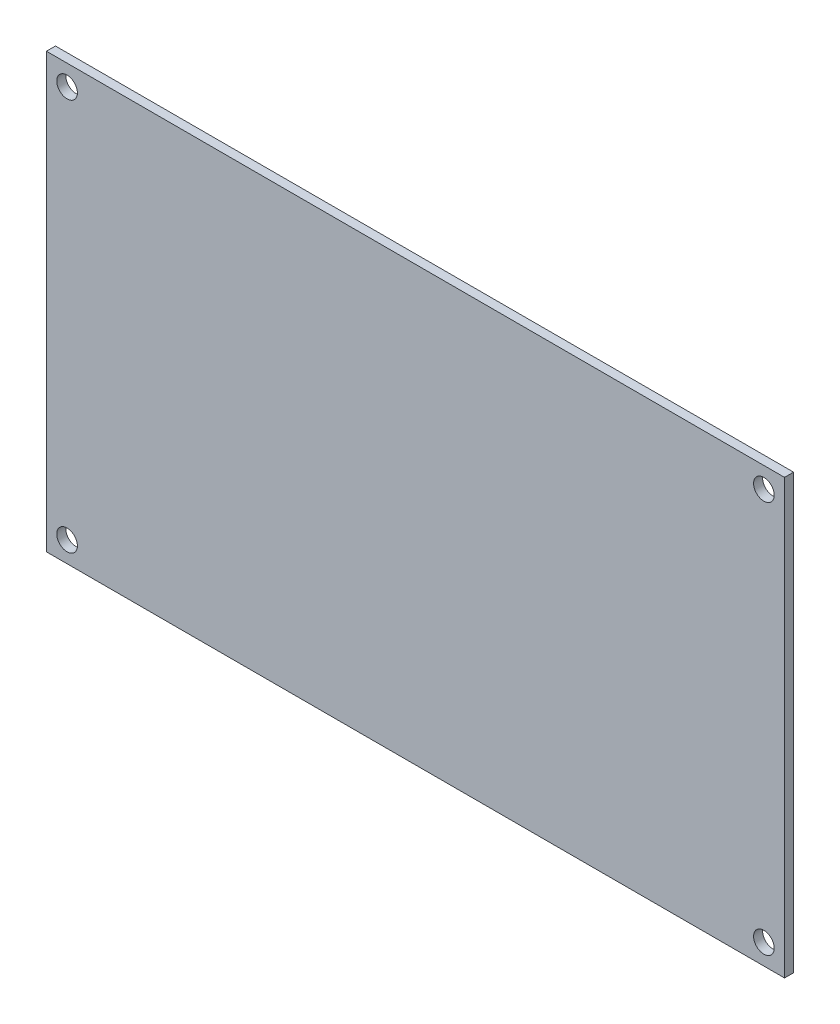
ISO-10303-21;
HEADER;
FILE_DESCRIPTION(('STEP AP214'),'2;1');
FILE_NAME('part.step','',(''),(''),'','','');
FILE_SCHEMA(('AUTOMOTIVE_DESIGN { 1 0 10303 214 1 1 1 1 }'));
ENDSEC;
DATA;
#1=APPLICATION_CONTEXT('core data for automotive mechanical design processes');
#2=APPLICATION_PROTOCOL_DEFINITION('international standard','automotive_design',2000,#1);
#3=PRODUCT_CONTEXT('',#1,'mechanical');
#4=PRODUCT('Part','Part','',(#3));
#5=PRODUCT_RELATED_PRODUCT_CATEGORY('part','',(#4));
#6=PRODUCT_DEFINITION_FORMATION('','',#4);
#7=PRODUCT_DEFINITION_CONTEXT('part definition',#1,'design');
#8=PRODUCT_DEFINITION('design','',#6,#7);
#9=PRODUCT_DEFINITION_SHAPE('','',#8);
#10=(LENGTH_UNIT() NAMED_UNIT(*) SI_UNIT(.MILLI.,.METRE.));
#11=(NAMED_UNIT(*) PLANE_ANGLE_UNIT() SI_UNIT($,.RADIAN.));
#12=(NAMED_UNIT(*) SI_UNIT($,.STERADIAN.) SOLID_ANGLE_UNIT());
#13=UNCERTAINTY_MEASURE_WITH_UNIT(LENGTH_MEASURE(1.E-05),#10,'distance_accuracy_value','');
#14=(GEOMETRIC_REPRESENTATION_CONTEXT(3) GLOBAL_UNCERTAINTY_ASSIGNED_CONTEXT((#13)) GLOBAL_UNIT_ASSIGNED_CONTEXT((#10,
#11,#12)) REPRESENTATION_CONTEXT('',''));
#15=CARTESIAN_POINT('',(0.,0.,0.));
#16=DIRECTION('',(0.,0.,1.));
#17=DIRECTION('',(1.,0.,0.));
#18=AXIS2_PLACEMENT_3D('',#15,#16,#17);
#19=CARTESIAN_POINT('',(0.,0.,1.75));
#20=DIRECTION('',(0.,0.,1.));
#21=DIRECTION('',(1.,0.,0.));
#22=AXIS2_PLACEMENT_3D('',#19,#20,#21);
#23=PLANE('',#22);
#24=CARTESIAN_POINT('',(67.5,38.,1.75));
#25=DIRECTION('',(0.,0.,-1.));
#26=DIRECTION('',(-1.,0.,0.));
#27=AXIS2_PLACEMENT_3D('',#24,#25,#26);
#28=CIRCLE('',#27,2.);
#29=CARTESIAN_POINT('',(65.5,38.,1.75));
#30=VERTEX_POINT('',#29);
#31=EDGE_CURVE('E92',#30,#30,#28,.T.);
#32=ORIENTED_EDGE('',*,*,#31,.T.);
#33=EDGE_LOOP('',(#32));
#34=FACE_BOUND('',#33,.T.);
#35=CARTESIAN_POINT('',(-67.5,-38.,1.75));
#36=DIRECTION('',(0.,0.,-1.));
#37=DIRECTION('',(-1.,0.,0.));
#38=AXIS2_PLACEMENT_3D('',#35,#36,#37);
#39=CIRCLE('',#38,2.);
#40=CARTESIAN_POINT('',(-69.5,-38.,1.75));
#41=VERTEX_POINT('',#40);
#42=EDGE_CURVE('E95',#41,#41,#39,.T.);
#43=ORIENTED_EDGE('',*,*,#42,.T.);
#44=EDGE_LOOP('',(#43));
#45=FACE_BOUND('',#44,.T.);
#46=CARTESIAN_POINT('',(-67.5,38.,1.75));
#47=DIRECTION('',(0.,0.,-1.));
#48=DIRECTION('',(-1.,0.,0.));
#49=AXIS2_PLACEMENT_3D('',#46,#47,#48);
#50=CIRCLE('',#49,2.);
#51=CARTESIAN_POINT('',(-69.5,38.,1.75));
#52=VERTEX_POINT('',#51);
#53=EDGE_CURVE('E97',#52,#52,#50,.T.);
#54=ORIENTED_EDGE('',*,*,#53,.T.);
#55=EDGE_LOOP('',(#54));
#56=FACE_BOUND('',#55,.T.);
#57=CARTESIAN_POINT('',(67.5,-38.,1.75));
#58=DIRECTION('',(0.,0.,-1.));
#59=DIRECTION('',(-1.,0.,0.));
#60=AXIS2_PLACEMENT_3D('',#57,#58,#59);
#61=CIRCLE('',#60,2.);
#62=CARTESIAN_POINT('',(65.5,-38.,1.75));
#63=VERTEX_POINT('',#62);
#64=EDGE_CURVE('E20',#63,#63,#61,.T.);
#65=ORIENTED_EDGE('',*,*,#64,.T.);
#66=EDGE_LOOP('',(#65));
#67=FACE_BOUND('',#66,.T.);
#68=DIRECTION('',(1.,0.,0.));
#69=VECTOR('',#68,1.);
#70=CARTESIAN_POINT('',(71.5,42.,1.75));
#71=LINE('',#70,#69);
#72=CARTESIAN_POINT('',(-71.5,42.,1.75));
#73=VERTEX_POINT('',#72);
#74=CARTESIAN_POINT('',(71.5,42.,1.75));
#75=VERTEX_POINT('',#74);
#76=EDGE_CURVE('E59',#73,#75,#71,.T.);
#77=ORIENTED_EDGE('',*,*,#76,.F.);
#78=DIRECTION('',(0.,1.,0.));
#79=VECTOR('',#78,1.);
#80=CARTESIAN_POINT('',(-71.5,42.,1.75));
#81=LINE('',#80,#79);
#82=CARTESIAN_POINT('',(-71.5,-42.,1.75));
#83=VERTEX_POINT('',#82);
#84=EDGE_CURVE('E54',#83,#73,#81,.T.);
#85=ORIENTED_EDGE('',*,*,#84,.F.);
#86=DIRECTION('',(1.,0.,0.));
#87=VECTOR('',#86,1.);
#88=CARTESIAN_POINT('',(-71.5,-42.,1.75));
#89=LINE('',#88,#87);
#90=CARTESIAN_POINT('',(71.5,-42.,1.75));
#91=VERTEX_POINT('',#90);
#92=EDGE_CURVE('E71',#91,#83,#89,.F.);
#93=ORIENTED_EDGE('',*,*,#92,.F.);
#94=DIRECTION('',(0.,1.,0.));
#95=VECTOR('',#94,1.);
#96=CARTESIAN_POINT('',(71.5,-42.,1.75));
#97=LINE('',#96,#95);
#98=EDGE_CURVE('E68',#75,#91,#97,.F.);
#99=ORIENTED_EDGE('',*,*,#98,.F.);
#100=EDGE_LOOP('',(#77,#85,#93,#99));
#101=FACE_BOUND('',#100,.T.);
#102=ADVANCED_FACE('F17',(#34,#45,#56,#67,#101),#23,.T.);
#103=CARTESIAN_POINT('',(71.5,-42.,0.));
#104=DIRECTION('',(1.,0.,0.));
#105=DIRECTION('',(0.,0.,-1.));
#106=AXIS2_PLACEMENT_3D('',#103,#104,#105);
#107=PLANE('',#106);
#108=ORIENTED_EDGE('',*,*,#98,.T.);
#109=DIRECTION('',(0.,0.,-1.));
#110=VECTOR('',#109,1.);
#111=CARTESIAN_POINT('',(71.5,-42.,0.));
#112=LINE('',#111,#110);
#113=CARTESIAN_POINT('',(71.5,-42.,0.));
#114=VERTEX_POINT('',#113);
#115=EDGE_CURVE('E105',#114,#91,#112,.F.);
#116=ORIENTED_EDGE('',*,*,#115,.F.);
#117=DIRECTION('',(0.,1.,0.));
#118=VECTOR('',#117,1.);
#119=CARTESIAN_POINT('',(71.5,0.,0.));
#120=LINE('',#119,#118);
#121=CARTESIAN_POINT('',(71.5,42.,0.));
#122=VERTEX_POINT('',#121);
#123=EDGE_CURVE('E78',#114,#122,#120,.T.);
#124=ORIENTED_EDGE('',*,*,#123,.T.);
#125=DIRECTION('',(0.,0.,1.));
#126=VECTOR('',#125,1.);
#127=CARTESIAN_POINT('',(71.5,42.,0.));
#128=LINE('',#127,#126);
#129=EDGE_CURVE('E64',#75,#122,#128,.F.);
#130=ORIENTED_EDGE('',*,*,#129,.F.);
#131=EDGE_LOOP('',(#108,#116,#124,#130));
#132=FACE_BOUND('',#131,.T.);
#133=ADVANCED_FACE('F77',(#132),#107,.T.);
#134=CARTESIAN_POINT('',(71.5,42.,0.));
#135=DIRECTION('',(0.,1.,0.));
#136=DIRECTION('',(0.,0.,1.));
#137=AXIS2_PLACEMENT_3D('',#134,#135,#136);
#138=PLANE('',#137);
#139=ORIENTED_EDGE('',*,*,#76,.T.);
#140=ORIENTED_EDGE('',*,*,#129,.T.);
#141=DIRECTION('',(1.,0.,0.));
#142=VECTOR('',#141,1.);
#143=CARTESIAN_POINT('',(0.,42.,0.));
#144=LINE('',#143,#142);
#145=CARTESIAN_POINT('',(-71.5,42.,0.));
#146=VERTEX_POINT('',#145);
#147=EDGE_CURVE('E116',#122,#146,#144,.F.);
#148=ORIENTED_EDGE('',*,*,#147,.T.);
#149=DIRECTION('',(0.,0.,1.));
#150=VECTOR('',#149,1.);
#151=CARTESIAN_POINT('',(-71.5,42.,0.));
#152=LINE('',#151,#150);
#153=EDGE_CURVE('E66',#73,#146,#152,.F.);
#154=ORIENTED_EDGE('',*,*,#153,.F.);
#155=EDGE_LOOP('',(#139,#140,#148,#154));
#156=FACE_BOUND('',#155,.T.);
#157=ADVANCED_FACE('F61',(#156),#138,.T.);
#158=CARTESIAN_POINT('',(-71.5,42.,0.));
#159=DIRECTION('',(-1.,0.,0.));
#160=DIRECTION('',(0.,0.,1.));
#161=AXIS2_PLACEMENT_3D('',#158,#159,#160);
#162=PLANE('',#161);
#163=ORIENTED_EDGE('',*,*,#84,.T.);
#164=ORIENTED_EDGE('',*,*,#153,.T.);
#165=DIRECTION('',(0.,1.,0.));
#166=VECTOR('',#165,1.);
#167=CARTESIAN_POINT('',(-71.5,0.,0.));
#168=LINE('',#167,#166);
#169=CARTESIAN_POINT('',(-71.5,-42.,0.));
#170=VERTEX_POINT('',#169);
#171=EDGE_CURVE('E113',#146,#170,#168,.F.);
#172=ORIENTED_EDGE('',*,*,#171,.T.);
#173=DIRECTION('',(0.,0.,-1.));
#174=VECTOR('',#173,1.);
#175=CARTESIAN_POINT('',(-71.5,-42.,0.));
#176=LINE('',#175,#174);
#177=EDGE_CURVE('E35',#83,#170,#176,.T.);
#178=ORIENTED_EDGE('',*,*,#177,.F.);
#179=EDGE_LOOP('',(#163,#164,#172,#178));
#180=FACE_BOUND('',#179,.T.);
#181=ADVANCED_FACE('F112',(#180),#162,.T.);
#182=CARTESIAN_POINT('',(-71.5,-42.,0.));
#183=DIRECTION('',(0.,-1.,0.));
#184=DIRECTION('',(0.,0.,-1.));
#185=AXIS2_PLACEMENT_3D('',#182,#183,#184);
#186=PLANE('',#185);
#187=ORIENTED_EDGE('',*,*,#92,.T.);
#188=ORIENTED_EDGE('',*,*,#177,.T.);
#189=DIRECTION('',(1.,0.,0.));
#190=VECTOR('',#189,1.);
#191=CARTESIAN_POINT('',(0.,-42.,0.));
#192=LINE('',#191,#190);
#193=EDGE_CURVE('E91',#170,#114,#192,.T.);
#194=ORIENTED_EDGE('',*,*,#193,.T.);
#195=ORIENTED_EDGE('',*,*,#115,.T.);
#196=EDGE_LOOP('',(#187,#188,#194,#195));
#197=FACE_BOUND('',#196,.T.);
#198=ADVANCED_FACE('F119',(#197),#186,.T.);
#199=CARTESIAN_POINT('',(67.5,-38.,0.7875));
#200=DIRECTION('',(0.,0.,-1.));
#201=DIRECTION('',(-1.,0.,0.));
#202=AXIS2_PLACEMENT_3D('',#199,#200,#201);
#203=CYLINDRICAL_SURFACE('',#202,2.);
#204=CARTESIAN_POINT('',(67.5,-38.,0.));
#205=DIRECTION('',(0.,0.,-1.));
#206=DIRECTION('',(-1.,0.,0.));
#207=AXIS2_PLACEMENT_3D('',#204,#205,#206);
#208=CIRCLE('',#207,2.);
#209=CARTESIAN_POINT('',(65.5,-38.,0.));
#210=VERTEX_POINT('',#209);
#211=EDGE_CURVE('E88',#210,#210,#208,.T.);
#212=ORIENTED_EDGE('',*,*,#211,.T.);
#213=EDGE_LOOP('',(#212));
#214=FACE_BOUND('',#213,.T.);
#215=ORIENTED_EDGE('',*,*,#64,.F.);
#216=EDGE_LOOP('',(#215));
#217=FACE_BOUND('',#216,.T.);
#218=ADVANCED_FACE('F121',(#214,#217),#203,.F.);
#219=CARTESIAN_POINT('',(-67.5,38.,0.7875));
#220=DIRECTION('',(0.,0.,-1.));
#221=DIRECTION('',(-1.,0.,0.));
#222=AXIS2_PLACEMENT_3D('',#219,#220,#221);
#223=CYLINDRICAL_SURFACE('',#222,2.);
#224=CARTESIAN_POINT('',(-67.5,38.,0.));
#225=DIRECTION('',(0.,0.,-1.));
#226=DIRECTION('',(-1.,0.,0.));
#227=AXIS2_PLACEMENT_3D('',#224,#225,#226);
#228=CIRCLE('',#227,2.);
#229=CARTESIAN_POINT('',(-69.5,38.,0.));
#230=VERTEX_POINT('',#229);
#231=EDGE_CURVE('E85',#230,#230,#228,.T.);
#232=ORIENTED_EDGE('',*,*,#231,.T.);
#233=EDGE_LOOP('',(#232));
#234=FACE_BOUND('',#233,.T.);
#235=ORIENTED_EDGE('',*,*,#53,.F.);
#236=EDGE_LOOP('',(#235));
#237=FACE_BOUND('',#236,.T.);
#238=ADVANCED_FACE('F128',(#234,#237),#223,.F.);
#239=CARTESIAN_POINT('',(-67.5,-38.,0.7875));
#240=DIRECTION('',(0.,0.,-1.));
#241=DIRECTION('',(-1.,0.,0.));
#242=AXIS2_PLACEMENT_3D('',#239,#240,#241);
#243=CYLINDRICAL_SURFACE('',#242,2.);
#244=CARTESIAN_POINT('',(-67.5,-38.,0.));
#245=DIRECTION('',(0.,0.,-1.));
#246=DIRECTION('',(-1.,0.,0.));
#247=AXIS2_PLACEMENT_3D('',#244,#245,#246);
#248=CIRCLE('',#247,2.);
#249=CARTESIAN_POINT('',(-69.5,-38.,0.));
#250=VERTEX_POINT('',#249);
#251=EDGE_CURVE('E26',#250,#250,#248,.T.);
#252=ORIENTED_EDGE('',*,*,#251,.T.);
#253=EDGE_LOOP('',(#252));
#254=FACE_BOUND('',#253,.T.);
#255=ORIENTED_EDGE('',*,*,#42,.F.);
#256=EDGE_LOOP('',(#255));
#257=FACE_BOUND('',#256,.T.);
#258=ADVANCED_FACE('F139',(#254,#257),#243,.F.);
#259=CARTESIAN_POINT('',(67.5,38.,0.7875));
#260=DIRECTION('',(0.,0.,-1.));
#261=DIRECTION('',(-1.,0.,0.));
#262=AXIS2_PLACEMENT_3D('',#259,#260,#261);
#263=CYLINDRICAL_SURFACE('',#262,2.);
#264=CARTESIAN_POINT('',(67.5,38.,0.));
#265=DIRECTION('',(0.,0.,-1.));
#266=DIRECTION('',(-1.,0.,0.));
#267=AXIS2_PLACEMENT_3D('',#264,#265,#266);
#268=CIRCLE('',#267,2.);
#269=CARTESIAN_POINT('',(65.5,38.,0.));
#270=VERTEX_POINT('',#269);
#271=EDGE_CURVE('E11',#270,#270,#268,.T.);
#272=ORIENTED_EDGE('',*,*,#271,.T.);
#273=EDGE_LOOP('',(#272));
#274=FACE_BOUND('',#273,.T.);
#275=ORIENTED_EDGE('',*,*,#31,.F.);
#276=EDGE_LOOP('',(#275));
#277=FACE_BOUND('',#276,.T.);
#278=ADVANCED_FACE('F133',(#274,#277),#263,.F.);
#279=CARTESIAN_POINT('',(0.,0.,0.));
#280=DIRECTION('',(0.,0.,1.));
#281=DIRECTION('',(1.,0.,0.));
#282=AXIS2_PLACEMENT_3D('',#279,#280,#281);
#283=PLANE('',#282);
#284=ORIENTED_EDGE('',*,*,#271,.F.);
#285=EDGE_LOOP('',(#284));
#286=FACE_BOUND('',#285,.T.);
#287=ORIENTED_EDGE('',*,*,#251,.F.);
#288=EDGE_LOOP('',(#287));
#289=FACE_BOUND('',#288,.T.);
#290=ORIENTED_EDGE('',*,*,#231,.F.);
#291=EDGE_LOOP('',(#290));
#292=FACE_BOUND('',#291,.T.);
#293=ORIENTED_EDGE('',*,*,#211,.F.);
#294=EDGE_LOOP('',(#293));
#295=FACE_BOUND('',#294,.T.);
#296=ORIENTED_EDGE('',*,*,#171,.F.);
#297=ORIENTED_EDGE('',*,*,#147,.F.);
#298=ORIENTED_EDGE('',*,*,#123,.F.);
#299=ORIENTED_EDGE('',*,*,#193,.F.);
#300=EDGE_LOOP('',(#296,#297,#298,#299));
#301=FACE_BOUND('',#300,.T.);
#302=ADVANCED_FACE('F115',(#286,#289,#292,#295,#301),#283,.F.);
#303=CLOSED_SHELL('',(#102,#133,#157,#181,#198,#218,#238,#258,#278,#302));
#304=MANIFOLD_SOLID_BREP('B1',#303);
#305=ADVANCED_BREP_SHAPE_REPRESENTATION('',(#18,#304),#14);
#306=SHAPE_DEFINITION_REPRESENTATION(#9,#305);
ENDSEC;
END-ISO-10303-21;
